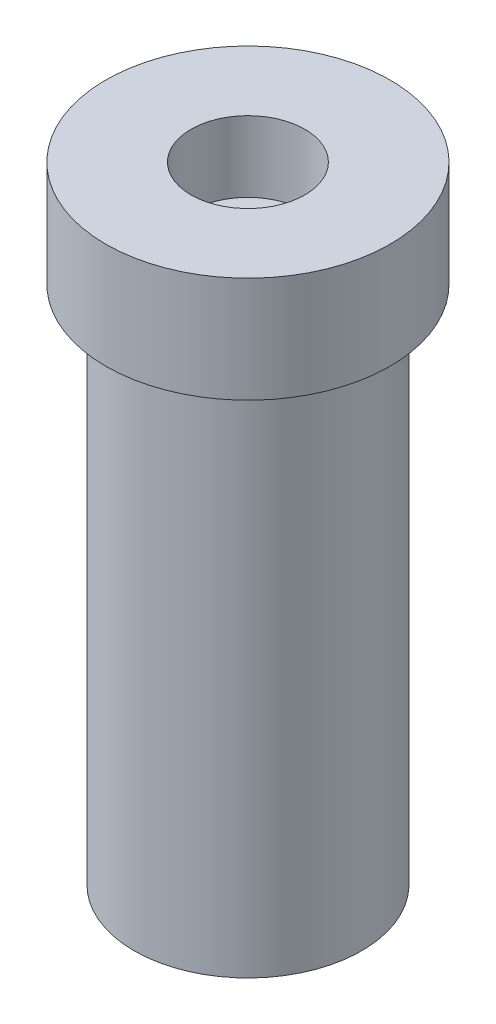
ISO-10303-21;
HEADER;
FILE_DESCRIPTION(('STEP AP214'),'2;1');
FILE_NAME('part.step','',(''),(''),'','','');
FILE_SCHEMA(('AUTOMOTIVE_DESIGN { 1 0 10303 214 1 1 1 1 }'));
ENDSEC;
DATA;
#1=APPLICATION_CONTEXT('core data for automotive mechanical design processes');
#2=APPLICATION_PROTOCOL_DEFINITION('international standard','automotive_design',2000,#1);
#3=PRODUCT_CONTEXT('',#1,'mechanical');
#4=PRODUCT('Part','Part','',(#3));
#5=PRODUCT_RELATED_PRODUCT_CATEGORY('part','',(#4));
#6=PRODUCT_DEFINITION_FORMATION('','',#4);
#7=PRODUCT_DEFINITION_CONTEXT('part definition',#1,'design');
#8=PRODUCT_DEFINITION('design','',#6,#7);
#9=PRODUCT_DEFINITION_SHAPE('','',#8);
#10=(LENGTH_UNIT() NAMED_UNIT(*) SI_UNIT(.MILLI.,.METRE.));
#11=(NAMED_UNIT(*) PLANE_ANGLE_UNIT() SI_UNIT($,.RADIAN.));
#12=(NAMED_UNIT(*) SI_UNIT($,.STERADIAN.) SOLID_ANGLE_UNIT());
#13=UNCERTAINTY_MEASURE_WITH_UNIT(LENGTH_MEASURE(1.E-05),#10,'distance_accuracy_value','');
#14=(GEOMETRIC_REPRESENTATION_CONTEXT(3) GLOBAL_UNCERTAINTY_ASSIGNED_CONTEXT((#13)) GLOBAL_UNIT_ASSIGNED_CONTEXT((#10,
#11,#12)) REPRESENTATION_CONTEXT('',''));
#15=CARTESIAN_POINT('',(0.,0.,0.));
#16=DIRECTION('',(0.,0.,1.));
#17=DIRECTION('',(1.,0.,0.));
#18=AXIS2_PLACEMENT_3D('',#15,#16,#17);
#19=CARTESIAN_POINT('',(0.,0.,0.));
#20=DIRECTION('',(0.,1.,0.));
#21=DIRECTION('',(0.,0.,1.));
#22=AXIS2_PLACEMENT_3D('',#19,#20,#21);
#23=PLANE('',#22);
#24=CARTESIAN_POINT('',(0.,0.,0.));
#25=DIRECTION('',(0.,1.,0.));
#26=DIRECTION('',(0.,0.,1.));
#27=AXIS2_PLACEMENT_3D('',#24,#25,#26);
#28=CIRCLE('',#27,1.75);
#29=CARTESIAN_POINT('',(0.,0.,1.75));
#30=VERTEX_POINT('',#29);
#31=EDGE_CURVE('E10',#30,#30,#28,.T.);
#32=ORIENTED_EDGE('',*,*,#31,.F.);
#33=EDGE_LOOP('',(#32));
#34=FACE_BOUND('',#33,.T.);
#35=ADVANCED_FACE('F37',(#34),#23,.F.);
#36=CARTESIAN_POINT('',(0.,11.5408623209632,0.));
#37=DIRECTION('',(0.,1.,0.));
#38=DIRECTION('',(0.,0.,1.));
#39=AXIS2_PLACEMENT_3D('',#36,#37,#38);
#40=CYLINDRICAL_SURFACE('',#39,1.75);
#41=CARTESIAN_POINT('',(0.,8.,0.));
#42=DIRECTION('',(0.,1.,0.));
#43=DIRECTION('',(0.,0.,1.));
#44=AXIS2_PLACEMENT_3D('',#41,#42,#43);
#45=CIRCLE('',#44,1.75);
#46=CARTESIAN_POINT('',(0.,8.,1.75));
#47=VERTEX_POINT('',#46);
#48=EDGE_CURVE('E44',#47,#47,#45,.T.);
#49=ORIENTED_EDGE('',*,*,#48,.F.);
#50=EDGE_LOOP('',(#49));
#51=FACE_BOUND('',#50,.T.);
#52=ORIENTED_EDGE('',*,*,#31,.T.);
#53=EDGE_LOOP('',(#52));
#54=FACE_BOUND('',#53,.T.);
#55=ADVANCED_FACE('F91',(#51,#54),#40,.T.);
#56=CARTESIAN_POINT('',(1.75,8.,0.));
#57=DIRECTION('',(0.,1.,0.));
#58=DIRECTION('',(0.,0.,1.));
#59=AXIS2_PLACEMENT_3D('',#56,#57,#58);
#60=PLANE('',#59);
#61=CARTESIAN_POINT('',(0.,8.,0.));
#62=DIRECTION('',(0.,1.,0.));
#63=DIRECTION('',(0.,0.,1.));
#64=AXIS2_PLACEMENT_3D('',#61,#62,#63);
#65=CIRCLE('',#64,2.18592349344911);
#66=CARTESIAN_POINT('',(0.,8.,2.18592349344911));
#67=VERTEX_POINT('',#66);
#68=EDGE_CURVE('E49',#67,#67,#65,.T.);
#69=ORIENTED_EDGE('',*,*,#68,.F.);
#70=EDGE_LOOP('',(#69));
#71=FACE_BOUND('',#70,.T.);
#72=ORIENTED_EDGE('',*,*,#48,.T.);
#73=EDGE_LOOP('',(#72));
#74=FACE_BOUND('',#73,.T.);
#75=ADVANCED_FACE('F86',(#71,#74),#60,.F.);
#76=CARTESIAN_POINT('',(0.,11.5408623209632,0.));
#77=DIRECTION('',(0.,1.,0.));
#78=DIRECTION('',(0.,0.,1.));
#79=AXIS2_PLACEMENT_3D('',#76,#77,#78);
#80=CYLINDRICAL_SURFACE('',#79,2.18592349344911);
#81=CARTESIAN_POINT('',(0.,9.62458526262216,0.));
#82=DIRECTION('',(0.,1.,0.));
#83=DIRECTION('',(0.,0.,1.));
#84=AXIS2_PLACEMENT_3D('',#81,#82,#83);
#85=CIRCLE('',#84,2.18592349344911);
#86=CARTESIAN_POINT('',(0.,9.62458526262216,2.18592349344911));
#87=VERTEX_POINT('',#86);
#88=EDGE_CURVE('E54',#87,#87,#85,.T.);
#89=ORIENTED_EDGE('',*,*,#88,.F.);
#90=EDGE_LOOP('',(#89));
#91=FACE_BOUND('',#90,.T.);
#92=ORIENTED_EDGE('',*,*,#68,.T.);
#93=EDGE_LOOP('',(#92));
#94=FACE_BOUND('',#93,.T.);
#95=ADVANCED_FACE('F80',(#91,#94),#80,.T.);
#96=CARTESIAN_POINT('',(2.18592349344911,9.62458526262216,0.));
#97=DIRECTION('',(0.,-1.,0.));
#98=DIRECTION('',(0.,0.,-1.));
#99=AXIS2_PLACEMENT_3D('',#96,#97,#98);
#100=PLANE('',#99);
#101=CARTESIAN_POINT('',(0.,9.62458526262216,0.));
#102=DIRECTION('',(0.,1.,0.));
#103=DIRECTION('',(0.,0.,1.));
#104=AXIS2_PLACEMENT_3D('',#101,#102,#103);
#105=CIRCLE('',#104,0.875);
#106=CARTESIAN_POINT('',(0.,9.62458526262216,0.875));
#107=VERTEX_POINT('',#106);
#108=EDGE_CURVE('E60',#107,#107,#105,.T.);
#109=ORIENTED_EDGE('',*,*,#108,.F.);
#110=EDGE_LOOP('',(#109));
#111=FACE_BOUND('',#110,.T.);
#112=ORIENTED_EDGE('',*,*,#88,.T.);
#113=EDGE_LOOP('',(#112));
#114=FACE_BOUND('',#113,.T.);
#115=ADVANCED_FACE('F74',(#111,#114),#100,.F.);
#116=CARTESIAN_POINT('',(0.,11.5408623209632,0.));
#117=DIRECTION('',(0.,1.,0.));
#118=DIRECTION('',(0.,0.,1.));
#119=AXIS2_PLACEMENT_3D('',#116,#117,#118);
#120=CYLINDRICAL_SURFACE('',#119,0.875);
#121=CARTESIAN_POINT('',(0.,8.53641365141449,0.));
#122=DIRECTION('',(0.,1.,0.));
#123=DIRECTION('',(0.,0.,1.));
#124=AXIS2_PLACEMENT_3D('',#121,#122,#123);
#125=CIRCLE('',#124,0.875);
#126=CARTESIAN_POINT('',(0.,8.53641365141449,0.875));
#127=VERTEX_POINT('',#126);
#128=EDGE_CURVE('E64',#127,#127,#125,.T.);
#129=ORIENTED_EDGE('',*,*,#128,.F.);
#130=EDGE_LOOP('',(#129));
#131=FACE_BOUND('',#130,.T.);
#132=ORIENTED_EDGE('',*,*,#108,.T.);
#133=EDGE_LOOP('',(#132));
#134=FACE_BOUND('',#133,.T.);
#135=ADVANCED_FACE('F71',(#131,#134),#120,.F.);
#136=CARTESIAN_POINT('',(0.875,8.53641365141449,0.));
#137=DIRECTION('',(0.,-1.,0.));
#138=DIRECTION('',(0.,0.,-1.));
#139=AXIS2_PLACEMENT_3D('',#136,#137,#138);
#140=PLANE('',#139);
#141=ORIENTED_EDGE('',*,*,#128,.T.);
#142=EDGE_LOOP('',(#141));
#143=FACE_BOUND('',#142,.T.);
#144=ADVANCED_FACE('F69',(#143),#140,.F.);
#145=CLOSED_SHELL('',(#35,#55,#75,#95,#115,#135,#144));
#146=MANIFOLD_SOLID_BREP('B2',#145);
#147=ADVANCED_BREP_SHAPE_REPRESENTATION('',(#18,#146),#14);
#148=SHAPE_DEFINITION_REPRESENTATION(#9,#147);
ENDSEC;
END-ISO-10303-21;
